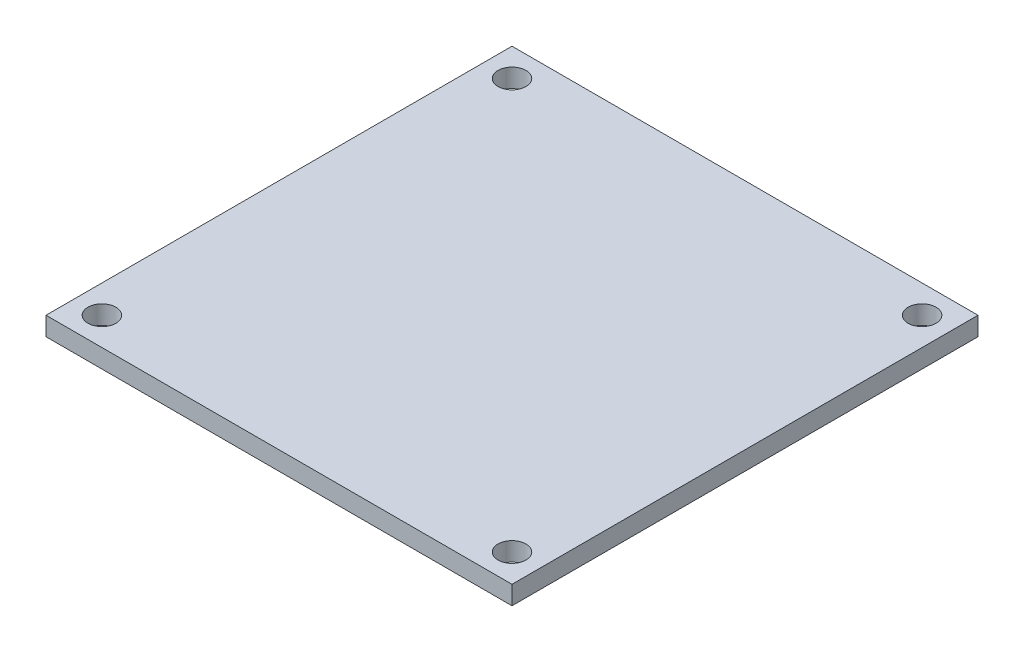
ISO-10303-21;
HEADER;
FILE_DESCRIPTION(('STEP AP214'),'2;1');
FILE_NAME('part.step','',(''),(''),'','','');
FILE_SCHEMA(('AUTOMOTIVE_DESIGN { 1 0 10303 214 1 1 1 1 }'));
ENDSEC;
DATA;
#1=APPLICATION_CONTEXT('core data for automotive mechanical design processes');
#2=APPLICATION_PROTOCOL_DEFINITION('international standard','automotive_design',2000,#1);
#3=PRODUCT_CONTEXT('',#1,'mechanical');
#4=PRODUCT('Part','Part','',(#3));
#5=PRODUCT_RELATED_PRODUCT_CATEGORY('part','',(#4));
#6=PRODUCT_DEFINITION_FORMATION('','',#4);
#7=PRODUCT_DEFINITION_CONTEXT('part definition',#1,'design');
#8=PRODUCT_DEFINITION('design','',#6,#7);
#9=PRODUCT_DEFINITION_SHAPE('','',#8);
#10=(LENGTH_UNIT() NAMED_UNIT(*) SI_UNIT(.MILLI.,.METRE.));
#11=(NAMED_UNIT(*) PLANE_ANGLE_UNIT() SI_UNIT($,.RADIAN.));
#12=(NAMED_UNIT(*) SI_UNIT($,.STERADIAN.) SOLID_ANGLE_UNIT());
#13=UNCERTAINTY_MEASURE_WITH_UNIT(LENGTH_MEASURE(1.E-05),#10,'distance_accuracy_value','');
#14=(GEOMETRIC_REPRESENTATION_CONTEXT(3) GLOBAL_UNCERTAINTY_ASSIGNED_CONTEXT((#13)) GLOBAL_UNIT_ASSIGNED_CONTEXT((#10,
#11,#12)) REPRESENTATION_CONTEXT('',''));
#15=CARTESIAN_POINT('',(0.,0.,0.));
#16=DIRECTION('',(0.,0.,1.));
#17=DIRECTION('',(1.,0.,0.));
#18=AXIS2_PLACEMENT_3D('',#15,#16,#17);
#19=CARTESIAN_POINT('',(0.,2.,0.));
#20=DIRECTION('',(0.,-1.,0.));
#21=DIRECTION('',(0.,0.,-1.));
#22=AXIS2_PLACEMENT_3D('',#19,#20,#21);
#23=PLANE('',#22);
#24=DIRECTION('',(0.,0.,1.));
#25=VECTOR('',#24,1.);
#26=CARTESIAN_POINT('',(-60.,2.,25.));
#27=LINE('',#26,#25);
#28=CARTESIAN_POINT('',(-60.,2.,-25.));
#29=VERTEX_POINT('',#28);
#30=CARTESIAN_POINT('',(-60.,2.,25.));
#31=VERTEX_POINT('',#30);
#32=EDGE_CURVE('E85',#29,#31,#27,.T.);
#33=ORIENTED_EDGE('',*,*,#32,.T.);
#34=DIRECTION('',(1.,0.,0.));
#35=VECTOR('',#34,1.);
#36=CARTESIAN_POINT('',(-60.,2.,25.));
#37=LINE('',#36,#35);
#38=CARTESIAN_POINT('',(-9.99999999999998,2.,25.));
#39=VERTEX_POINT('',#38);
#40=EDGE_CURVE('E80',#31,#39,#37,.T.);
#41=ORIENTED_EDGE('',*,*,#40,.T.);
#42=DIRECTION('',(0.,0.,-1.));
#43=VECTOR('',#42,1.);
#44=CARTESIAN_POINT('',(-9.99999999999999,2.,-25.));
#45=LINE('',#44,#43);
#46=CARTESIAN_POINT('',(-9.99999999999999,2.,-25.));
#47=VERTEX_POINT('',#46);
#48=EDGE_CURVE('E83',#39,#47,#45,.T.);
#49=ORIENTED_EDGE('',*,*,#48,.T.);
#50=DIRECTION('',(-1.,0.,0.));
#51=VECTOR('',#50,1.);
#52=CARTESIAN_POINT('',(-60.,2.,-25.));
#53=LINE('',#52,#51);
#54=EDGE_CURVE('E50',#47,#29,#53,.T.);
#55=ORIENTED_EDGE('',*,*,#54,.T.);
#56=EDGE_LOOP('',(#33,#41,#49,#55));
#57=FACE_BOUND('',#56,.T.);
#58=CARTESIAN_POINT('',(-13.,2.,22.));
#59=DIRECTION('',(0.,1.,0.));
#60=DIRECTION('',(0.,0.,1.));
#61=AXIS2_PLACEMENT_3D('',#58,#59,#60);
#62=CIRCLE('',#61,1.5);
#63=CARTESIAN_POINT('',(-13.,2.,23.5));
#64=VERTEX_POINT('',#63);
#65=EDGE_CURVE('E100',#64,#64,#62,.T.);
#66=ORIENTED_EDGE('',*,*,#65,.F.);
#67=EDGE_LOOP('',(#66));
#68=FACE_BOUND('',#67,.T.);
#69=CARTESIAN_POINT('',(-13.0000000000001,2.,-22.));
#70=DIRECTION('',(0.,1.,0.));
#71=DIRECTION('',(0.,0.,1.));
#72=AXIS2_PLACEMENT_3D('',#69,#70,#71);
#73=CIRCLE('',#72,1.5);
#74=CARTESIAN_POINT('',(-13.0000000000001,2.,-20.5));
#75=VERTEX_POINT('',#74);
#76=EDGE_CURVE('E115',#75,#75,#73,.T.);
#77=ORIENTED_EDGE('',*,*,#76,.F.);
#78=EDGE_LOOP('',(#77));
#79=FACE_BOUND('',#78,.T.);
#80=CARTESIAN_POINT('',(-57.,2.,22.));
#81=DIRECTION('',(0.,1.,0.));
#82=DIRECTION('',(0.,0.,1.));
#83=AXIS2_PLACEMENT_3D('',#80,#81,#82);
#84=CIRCLE('',#83,1.5);
#85=CARTESIAN_POINT('',(-57.,2.,23.5));
#86=VERTEX_POINT('',#85);
#87=EDGE_CURVE('E121',#86,#86,#84,.T.);
#88=ORIENTED_EDGE('',*,*,#87,.F.);
#89=EDGE_LOOP('',(#88));
#90=FACE_BOUND('',#89,.T.);
#91=CARTESIAN_POINT('',(-57.0000000000001,2.,-22.));
#92=DIRECTION('',(0.,1.,0.));
#93=DIRECTION('',(0.,0.,1.));
#94=AXIS2_PLACEMENT_3D('',#91,#92,#93);
#95=CIRCLE('',#94,1.5);
#96=CARTESIAN_POINT('',(-57.0000000000001,2.,-20.5));
#97=VERTEX_POINT('',#96);
#98=EDGE_CURVE('E127',#97,#97,#95,.T.);
#99=ORIENTED_EDGE('',*,*,#98,.F.);
#100=EDGE_LOOP('',(#99));
#101=FACE_BOUND('',#100,.T.);
#102=ADVANCED_FACE('F33',(#57,#68,#79,#90,#101),#23,.F.);
#103=CARTESIAN_POINT('',(0.,0.,0.));
#104=DIRECTION('',(0.,-1.,0.));
#105=DIRECTION('',(0.,0.,-1.));
#106=AXIS2_PLACEMENT_3D('',#103,#104,#105);
#107=PLANE('',#106);
#108=CARTESIAN_POINT('',(-57.,0.,22.));
#109=DIRECTION('',(0.,1.,0.));
#110=DIRECTION('',(0.,0.,1.));
#111=AXIS2_PLACEMENT_3D('',#108,#109,#110);
#112=CIRCLE('',#111,1.5);
#113=CARTESIAN_POINT('',(-57.,0.,23.5));
#114=VERTEX_POINT('',#113);
#115=EDGE_CURVE('E124',#114,#114,#112,.T.);
#116=ORIENTED_EDGE('',*,*,#115,.T.);
#117=EDGE_LOOP('',(#116));
#118=FACE_BOUND('',#117,.T.);
#119=CARTESIAN_POINT('',(-13.,0.,22.));
#120=DIRECTION('',(0.,1.,0.));
#121=DIRECTION('',(0.,0.,1.));
#122=AXIS2_PLACEMENT_3D('',#119,#120,#121);
#123=CIRCLE('',#122,1.5);
#124=CARTESIAN_POINT('',(-13.,0.,23.5));
#125=VERTEX_POINT('',#124);
#126=EDGE_CURVE('E112',#125,#125,#123,.T.);
#127=ORIENTED_EDGE('',*,*,#126,.T.);
#128=EDGE_LOOP('',(#127));
#129=FACE_BOUND('',#128,.T.);
#130=DIRECTION('',(0.,0.,1.));
#131=VECTOR('',#130,1.);
#132=CARTESIAN_POINT('',(-60.,0.,25.));
#133=LINE('',#132,#131);
#134=CARTESIAN_POINT('',(-60.,0.,-25.));
#135=VERTEX_POINT('',#134);
#136=CARTESIAN_POINT('',(-60.,0.,25.));
#137=VERTEX_POINT('',#136);
#138=EDGE_CURVE('E97',#135,#137,#133,.T.);
#139=ORIENTED_EDGE('',*,*,#138,.F.);
#140=DIRECTION('',(-1.,0.,0.));
#141=VECTOR('',#140,1.);
#142=CARTESIAN_POINT('',(-60.,0.,-25.));
#143=LINE('',#142,#141);
#144=CARTESIAN_POINT('',(-9.99999999999999,0.,-25.));
#145=VERTEX_POINT('',#144);
#146=EDGE_CURVE('E73',#145,#135,#143,.T.);
#147=ORIENTED_EDGE('',*,*,#146,.F.);
#148=DIRECTION('',(0.,0.,-1.));
#149=VECTOR('',#148,1.);
#150=CARTESIAN_POINT('',(-9.99999999999999,0.,-25.));
#151=LINE('',#150,#149);
#152=CARTESIAN_POINT('',(-9.99999999999998,0.,25.));
#153=VERTEX_POINT('',#152);
#154=EDGE_CURVE('E67',#153,#145,#151,.T.);
#155=ORIENTED_EDGE('',*,*,#154,.F.);
#156=DIRECTION('',(1.,0.,0.));
#157=VECTOR('',#156,1.);
#158=CARTESIAN_POINT('',(-60.,0.,25.));
#159=LINE('',#158,#157);
#160=EDGE_CURVE('E89',#137,#153,#159,.T.);
#161=ORIENTED_EDGE('',*,*,#160,.F.);
#162=EDGE_LOOP('',(#139,#147,#155,#161));
#163=FACE_BOUND('',#162,.T.);
#164=CARTESIAN_POINT('',(-13.0000000000001,0.,-22.));
#165=DIRECTION('',(0.,1.,0.));
#166=DIRECTION('',(0.,0.,1.));
#167=AXIS2_PLACEMENT_3D('',#164,#165,#166);
#168=CIRCLE('',#167,1.5);
#169=CARTESIAN_POINT('',(-13.0000000000001,0.,-20.5));
#170=VERTEX_POINT('',#169);
#171=EDGE_CURVE('E118',#170,#170,#168,.T.);
#172=ORIENTED_EDGE('',*,*,#171,.T.);
#173=EDGE_LOOP('',(#172));
#174=FACE_BOUND('',#173,.T.);
#175=CARTESIAN_POINT('',(-57.0000000000001,0.,-22.));
#176=DIRECTION('',(0.,1.,0.));
#177=DIRECTION('',(0.,0.,1.));
#178=AXIS2_PLACEMENT_3D('',#175,#176,#177);
#179=CIRCLE('',#178,1.5);
#180=CARTESIAN_POINT('',(-57.0000000000001,0.,-20.5));
#181=VERTEX_POINT('',#180);
#182=EDGE_CURVE('E130',#181,#181,#179,.T.);
#183=ORIENTED_EDGE('',*,*,#182,.T.);
#184=EDGE_LOOP('',(#183));
#185=FACE_BOUND('',#184,.T.);
#186=ADVANCED_FACE('F108',(#118,#129,#163,#174,#185),#107,.T.);
#187=CARTESIAN_POINT('',(-60.,2.,25.));
#188=DIRECTION('',(1.,0.,0.));
#189=DIRECTION('',(0.,0.,-1.));
#190=AXIS2_PLACEMENT_3D('',#187,#188,#189);
#191=PLANE('',#190);
#192=ORIENTED_EDGE('',*,*,#138,.T.);
#193=DIRECTION('',(0.,-1.,0.));
#194=VECTOR('',#193,1.);
#195=CARTESIAN_POINT('',(-60.,2.,25.));
#196=LINE('',#195,#194);
#197=EDGE_CURVE('E11',#31,#137,#196,.T.);
#198=ORIENTED_EDGE('',*,*,#197,.F.);
#199=ORIENTED_EDGE('',*,*,#32,.F.);
#200=DIRECTION('',(0.,-1.,0.));
#201=VECTOR('',#200,1.);
#202=CARTESIAN_POINT('',(-60.,2.,-25.));
#203=LINE('',#202,#201);
#204=EDGE_CURVE('E93',#29,#135,#203,.T.);
#205=ORIENTED_EDGE('',*,*,#204,.T.);
#206=EDGE_LOOP('',(#192,#198,#199,#205));
#207=FACE_BOUND('',#206,.T.);
#208=ADVANCED_FACE('F35',(#207),#191,.F.);
#209=CARTESIAN_POINT('',(-60.,2.,25.));
#210=DIRECTION('',(0.,0.,-1.));
#211=DIRECTION('',(-1.,0.,0.));
#212=AXIS2_PLACEMENT_3D('',#209,#210,#211);
#213=PLANE('',#212);
#214=ORIENTED_EDGE('',*,*,#160,.T.);
#215=DIRECTION('',(0.,-1.,0.));
#216=VECTOR('',#215,1.);
#217=CARTESIAN_POINT('',(-9.99999999999998,2.,25.));
#218=LINE('',#217,#216);
#219=EDGE_CURVE('E42',#39,#153,#218,.T.);
#220=ORIENTED_EDGE('',*,*,#219,.F.);
#221=ORIENTED_EDGE('',*,*,#40,.F.);
#222=ORIENTED_EDGE('',*,*,#197,.T.);
#223=EDGE_LOOP('',(#214,#220,#221,#222));
#224=FACE_BOUND('',#223,.T.);
#225=ADVANCED_FACE('F88',(#224),#213,.F.);
#226=CARTESIAN_POINT('',(-9.99999999999999,2.,-25.));
#227=DIRECTION('',(-1.,0.,0.));
#228=DIRECTION('',(0.,0.,1.));
#229=AXIS2_PLACEMENT_3D('',#226,#227,#228);
#230=PLANE('',#229);
#231=ORIENTED_EDGE('',*,*,#154,.T.);
#232=DIRECTION('',(0.,-1.,0.));
#233=VECTOR('',#232,1.);
#234=CARTESIAN_POINT('',(-9.99999999999999,2.,-25.));
#235=LINE('',#234,#233);
#236=EDGE_CURVE('E90',#47,#145,#235,.T.);
#237=ORIENTED_EDGE('',*,*,#236,.F.);
#238=ORIENTED_EDGE('',*,*,#48,.F.);
#239=ORIENTED_EDGE('',*,*,#219,.T.);
#240=EDGE_LOOP('',(#231,#237,#238,#239));
#241=FACE_BOUND('',#240,.T.);
#242=ADVANCED_FACE('F91',(#241),#230,.F.);
#243=CARTESIAN_POINT('',(-60.,2.,-25.));
#244=DIRECTION('',(0.,0.,1.));
#245=DIRECTION('',(1.,0.,0.));
#246=AXIS2_PLACEMENT_3D('',#243,#244,#245);
#247=PLANE('',#246);
#248=ORIENTED_EDGE('',*,*,#146,.T.);
#249=ORIENTED_EDGE('',*,*,#204,.F.);
#250=ORIENTED_EDGE('',*,*,#54,.F.);
#251=ORIENTED_EDGE('',*,*,#236,.T.);
#252=EDGE_LOOP('',(#248,#249,#250,#251));
#253=FACE_BOUND('',#252,.T.);
#254=ADVANCED_FACE('F105',(#253),#247,.F.);
#255=CARTESIAN_POINT('',(-13.,2.,22.));
#256=DIRECTION('',(0.,-1.,0.));
#257=DIRECTION('',(0.,0.,-1.));
#258=AXIS2_PLACEMENT_3D('',#255,#256,#257);
#259=CYLINDRICAL_SURFACE('',#258,1.5);
#260=ORIENTED_EDGE('',*,*,#65,.T.);
#261=EDGE_LOOP('',(#260));
#262=FACE_BOUND('',#261,.T.);
#263=ORIENTED_EDGE('',*,*,#126,.F.);
#264=EDGE_LOOP('',(#263));
#265=FACE_BOUND('',#264,.T.);
#266=ADVANCED_FACE('F147',(#262,#265),#259,.F.);
#267=CARTESIAN_POINT('',(-13.0000000000001,2.,-22.));
#268=DIRECTION('',(0.,-1.,0.));
#269=DIRECTION('',(0.,0.,-1.));
#270=AXIS2_PLACEMENT_3D('',#267,#268,#269);
#271=CYLINDRICAL_SURFACE('',#270,1.5);
#272=ORIENTED_EDGE('',*,*,#76,.T.);
#273=EDGE_LOOP('',(#272));
#274=FACE_BOUND('',#273,.T.);
#275=ORIENTED_EDGE('',*,*,#171,.F.);
#276=EDGE_LOOP('',(#275));
#277=FACE_BOUND('',#276,.T.);
#278=ADVANCED_FACE('F193',(#274,#277),#271,.F.);
#279=CARTESIAN_POINT('',(-57.,2.,22.));
#280=DIRECTION('',(0.,-1.,0.));
#281=DIRECTION('',(0.,0.,-1.));
#282=AXIS2_PLACEMENT_3D('',#279,#280,#281);
#283=CYLINDRICAL_SURFACE('',#282,1.5);
#284=ORIENTED_EDGE('',*,*,#87,.T.);
#285=EDGE_LOOP('',(#284));
#286=FACE_BOUND('',#285,.T.);
#287=ORIENTED_EDGE('',*,*,#115,.F.);
#288=EDGE_LOOP('',(#287));
#289=FACE_BOUND('',#288,.T.);
#290=ADVANCED_FACE('F201',(#286,#289),#283,.F.);
#291=CARTESIAN_POINT('',(-57.0000000000001,2.,-22.));
#292=DIRECTION('',(0.,-1.,0.));
#293=DIRECTION('',(0.,0.,-1.));
#294=AXIS2_PLACEMENT_3D('',#291,#292,#293);
#295=CYLINDRICAL_SURFACE('',#294,1.5);
#296=ORIENTED_EDGE('',*,*,#98,.T.);
#297=EDGE_LOOP('',(#296));
#298=FACE_BOUND('',#297,.T.);
#299=ORIENTED_EDGE('',*,*,#182,.F.);
#300=EDGE_LOOP('',(#299));
#301=FACE_BOUND('',#300,.T.);
#302=ADVANCED_FACE('F136',(#298,#301),#295,.F.);
#303=CLOSED_SHELL('',(#102,#186,#208,#225,#242,#254,#266,#278,#290,#302));
#304=MANIFOLD_SOLID_BREP('B2',#303);
#305=ADVANCED_BREP_SHAPE_REPRESENTATION('',(#18,#304),#14);
#306=SHAPE_DEFINITION_REPRESENTATION(#9,#305);
ENDSEC;
END-ISO-10303-21;
